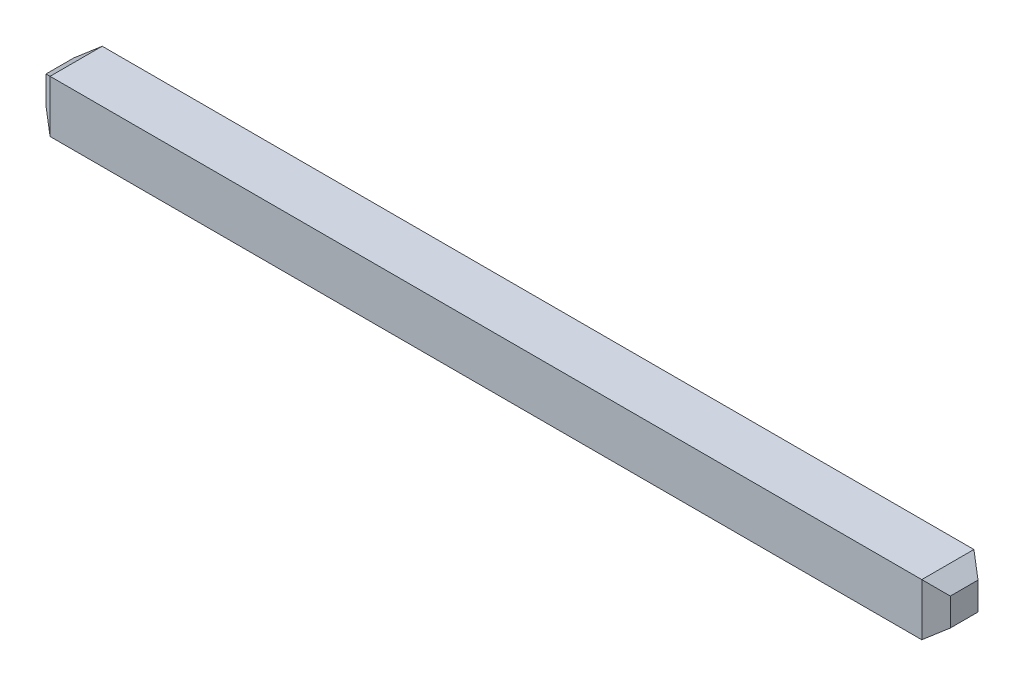
ISO-10303-21;
HEADER;
FILE_DESCRIPTION(('STEP AP214'),'2;1');
FILE_NAME('part.step','',(''),(''),'','','');
FILE_SCHEMA(('AUTOMOTIVE_DESIGN { 1 0 10303 214 1 1 1 1 }'));
ENDSEC;
DATA;
#1=APPLICATION_CONTEXT('core data for automotive mechanical design processes');
#2=APPLICATION_PROTOCOL_DEFINITION('international standard','automotive_design',2000,#1);
#3=PRODUCT_CONTEXT('',#1,'mechanical');
#4=PRODUCT('Part','Part','',(#3));
#5=PRODUCT_RELATED_PRODUCT_CATEGORY('part','',(#4));
#6=PRODUCT_DEFINITION_FORMATION('','',#4);
#7=PRODUCT_DEFINITION_CONTEXT('part definition',#1,'design');
#8=PRODUCT_DEFINITION('design','',#6,#7);
#9=PRODUCT_DEFINITION_SHAPE('','',#8);
#10=(LENGTH_UNIT() NAMED_UNIT(*) SI_UNIT(.MILLI.,.METRE.));
#11=(NAMED_UNIT(*) PLANE_ANGLE_UNIT() SI_UNIT($,.RADIAN.));
#12=(NAMED_UNIT(*) SI_UNIT($,.STERADIAN.) SOLID_ANGLE_UNIT());
#13=UNCERTAINTY_MEASURE_WITH_UNIT(LENGTH_MEASURE(1.E-05),#10,'distance_accuracy_value','');
#14=(GEOMETRIC_REPRESENTATION_CONTEXT(3) GLOBAL_UNCERTAINTY_ASSIGNED_CONTEXT((#13)) GLOBAL_UNIT_ASSIGNED_CONTEXT((#10,
#11,#12)) REPRESENTATION_CONTEXT('',''));
#15=CARTESIAN_POINT('',(0.,0.,0.));
#16=DIRECTION('',(0.,0.,1.));
#17=DIRECTION('',(1.,0.,0.));
#18=AXIS2_PLACEMENT_3D('',#15,#16,#17);
#19=CARTESIAN_POINT('',(-2.4,1.23,-4.055));
#20=DIRECTION('',(0.6,0.,0.8));
#21=DIRECTION('',(0.8,0.,-0.6));
#22=AXIS2_PLACEMENT_3D('',#19,#20,#21);
#23=PLANE('',#22);
#24=DIRECTION('',(0.,1.,0.));
#25=VECTOR('',#24,1.);
#26=CARTESIAN_POINT('',(-2.3,1.23,-4.13));
#27=LINE('',#26,#25);
#28=CARTESIAN_POINT('',(-2.3,1.55,-4.13));
#29=VERTEX_POINT('',#28);
#30=CARTESIAN_POINT('',(-2.30000000000001,0.909999999999898,-4.13));
#31=VERTEX_POINT('',#30);
#32=EDGE_CURVE('E101',#29,#31,#27,.F.);
#33=ORIENTED_EDGE('',*,*,#32,.T.);
#34=DIRECTION('',(-0.685994340569492,0.514495755428341,0.514495755427436));
#35=VECTOR('',#34,1.);
#36=CARTESIAN_POINT('',(-2.30000000000009,0.909999999999786,-4.13));
#37=LINE('',#36,#35);
#38=CARTESIAN_POINT('',(-2.49999999999999,1.06000000000001,-3.98));
#39=VERTEX_POINT('',#38);
#40=EDGE_CURVE('E85',#31,#39,#37,.T.);
#41=ORIENTED_EDGE('',*,*,#40,.T.);
#42=DIRECTION('',(0.,1.,0.));
#43=VECTOR('',#42,1.);
#44=CARTESIAN_POINT('',(-2.5,1.23,-3.98));
#45=LINE('',#44,#43);
#46=CARTESIAN_POINT('',(-2.5,1.4,-3.98));
#47=VERTEX_POINT('',#46);
#48=EDGE_CURVE('E79',#39,#47,#45,.T.);
#49=ORIENTED_EDGE('',*,*,#48,.T.);
#50=DIRECTION('',(-0.685994340570035,-0.514495755427527,0.514495755427526));
#51=VECTOR('',#50,1.);
#52=CARTESIAN_POINT('',(-2.3,1.55,-4.13));
#53=LINE('',#52,#51);
#54=EDGE_CURVE('E20',#29,#47,#53,.T.);
#55=ORIENTED_EDGE('',*,*,#54,.F.);
#56=EDGE_LOOP('',(#33,#41,#49,#55));
#57=FACE_BOUND('',#56,.T.);
#58=ADVANCED_FACE('F17',(#57),#23,.F.);
#59=CARTESIAN_POINT('',(8.5,1.23,-4.055));
#60=DIRECTION('',(-0.6,0.,0.8));
#61=DIRECTION('',(0.8,0.,0.6));
#62=AXIS2_PLACEMENT_3D('',#59,#60,#61);
#63=PLANE('',#62);
#64=DIRECTION('',(0.,1.,0.));
#65=VECTOR('',#64,1.);
#66=CARTESIAN_POINT('',(8.6,1.23,-3.98));
#67=LINE('',#66,#65);
#68=CARTESIAN_POINT('',(8.59999999999998,1.06000000000003,-3.98));
#69=VERTEX_POINT('',#68);
#70=CARTESIAN_POINT('',(8.6,1.4,-3.98));
#71=VERTEX_POINT('',#70);
#72=EDGE_CURVE('E113',#69,#71,#67,.T.);
#73=ORIENTED_EDGE('',*,*,#72,.F.);
#74=DIRECTION('',(-0.685994340569493,-0.514495755428341,-0.514495755427435));
#75=VECTOR('',#74,1.);
#76=CARTESIAN_POINT('',(8.59999999999996,1.06000000000005,-3.98));
#77=LINE('',#76,#75);
#78=CARTESIAN_POINT('',(8.40000000000002,0.909999999999884,-4.13));
#79=VERTEX_POINT('',#78);
#80=EDGE_CURVE('E108',#69,#79,#77,.T.);
#81=ORIENTED_EDGE('',*,*,#80,.T.);
#82=DIRECTION('',(0.,1.,0.));
#83=VECTOR('',#82,1.);
#84=CARTESIAN_POINT('',(8.4,1.23,-4.13));
#85=LINE('',#84,#83);
#86=CARTESIAN_POINT('',(8.4,1.55,-4.13));
#87=VERTEX_POINT('',#86);
#88=EDGE_CURVE('E99',#79,#87,#85,.T.);
#89=ORIENTED_EDGE('',*,*,#88,.T.);
#90=DIRECTION('',(-0.685994340570034,0.514495755427526,-0.514495755427529));
#91=VECTOR('',#90,1.);
#92=CARTESIAN_POINT('',(8.6,1.4,-3.98));
#93=LINE('',#92,#91);
#94=EDGE_CURVE('E116',#71,#87,#93,.T.);
#95=ORIENTED_EDGE('',*,*,#94,.F.);
#96=EDGE_LOOP('',(#73,#81,#89,#95));
#97=FACE_BOUND('',#96,.T.);
#98=ADVANCED_FACE('F214',(#97),#63,.F.);
#99=CARTESIAN_POINT('',(-2.4,1.475,-3.81));
#100=DIRECTION('',(-0.6,0.8,0.));
#101=DIRECTION('',(-0.8,-0.6,0.));
#102=AXIS2_PLACEMENT_3D('',#99,#100,#101);
#103=PLANE('',#102);
#104=DIRECTION('',(-0.685994340570036,-0.514495755427527,-0.514495755427525));
#105=VECTOR('',#104,1.);
#106=CARTESIAN_POINT('',(-2.3,1.55,-3.49));
#107=LINE('',#106,#105);
#108=CARTESIAN_POINT('',(-2.3,1.55,-3.49));
#109=VERTEX_POINT('',#108);
#110=CARTESIAN_POINT('',(-2.5,1.4,-3.64));
#111=VERTEX_POINT('',#110);
#112=EDGE_CURVE('E128',#109,#111,#107,.T.);
#113=ORIENTED_EDGE('',*,*,#112,.F.);
#114=DIRECTION('',(0.,0.,1.));
#115=VECTOR('',#114,1.);
#116=CARTESIAN_POINT('',(-2.3,1.55,-3.81));
#117=LINE('',#116,#115);
#118=EDGE_CURVE('E93',#29,#109,#117,.T.);
#119=ORIENTED_EDGE('',*,*,#118,.F.);
#120=ORIENTED_EDGE('',*,*,#54,.T.);
#121=DIRECTION('',(0.,0.,-1.));
#122=VECTOR('',#121,1.);
#123=CARTESIAN_POINT('',(-2.5,1.4,-3.81));
#124=LINE('',#123,#122);
#125=EDGE_CURVE('E87',#47,#111,#124,.F.);
#126=ORIENTED_EDGE('',*,*,#125,.T.);
#127=EDGE_LOOP('',(#113,#119,#120,#126));
#128=FACE_BOUND('',#127,.T.);
#129=ADVANCED_FACE('F90',(#128),#103,.T.);
#130=CARTESIAN_POINT('',(-2.5,1.23,-3.81));
#131=DIRECTION('',(1.,0.,0.));
#132=DIRECTION('',(0.,0.,-1.));
#133=AXIS2_PLACEMENT_3D('',#130,#131,#132);
#134=PLANE('',#133);
#135=DIRECTION('',(0.,1.,0.));
#136=VECTOR('',#135,1.);
#137=CARTESIAN_POINT('',(-2.5,1.23,-3.64));
#138=LINE('',#137,#136);
#139=CARTESIAN_POINT('',(-2.49999999999999,1.06000000000001,-3.64));
#140=VERTEX_POINT('',#139);
#141=EDGE_CURVE('E97',#111,#140,#138,.F.);
#142=ORIENTED_EDGE('',*,*,#141,.F.);
#143=ORIENTED_EDGE('',*,*,#125,.F.);
#144=ORIENTED_EDGE('',*,*,#48,.F.);
#145=DIRECTION('',(0.,0.,1.));
#146=VECTOR('',#145,1.);
#147=CARTESIAN_POINT('',(-2.49999999999996,1.06000000000005,-3.81));
#148=LINE('',#147,#146);
#149=EDGE_CURVE('E105',#39,#140,#148,.T.);
#150=ORIENTED_EDGE('',*,*,#149,.T.);
#151=EDGE_LOOP('',(#142,#143,#144,#150));
#152=FACE_BOUND('',#151,.T.);
#153=ADVANCED_FACE('F95',(#152),#134,.F.);
#154=CARTESIAN_POINT('',(3.05,1.23,-4.13));
#155=DIRECTION('',(0.,0.,1.));
#156=DIRECTION('',(1.,0.,0.));
#157=AXIS2_PLACEMENT_3D('',#154,#155,#156);
#158=PLANE('',#157);
#159=ORIENTED_EDGE('',*,*,#32,.F.);
#160=DIRECTION('',(1.,0.,0.));
#161=VECTOR('',#160,1.);
#162=CARTESIAN_POINT('',(3.05,1.55,-4.13));
#163=LINE('',#162,#161);
#164=EDGE_CURVE('E122',#87,#29,#163,.F.);
#165=ORIENTED_EDGE('',*,*,#164,.F.);
#166=ORIENTED_EDGE('',*,*,#88,.F.);
#167=DIRECTION('',(1.,0.,0.));
#168=VECTOR('',#167,1.);
#169=CARTESIAN_POINT('',(3.05,0.91,-4.13));
#170=LINE('',#169,#168);
#171=EDGE_CURVE('E136',#79,#31,#170,.F.);
#172=ORIENTED_EDGE('',*,*,#171,.T.);
#173=EDGE_LOOP('',(#159,#165,#166,#172));
#174=FACE_BOUND('',#173,.T.);
#175=ADVANCED_FACE('F182',(#174),#158,.F.);
#176=CARTESIAN_POINT('',(-2.4,0.9849999999999,-3.81));
#177=DIRECTION('',(0.600000000000912,0.799999999999316,0.));
#178=DIRECTION('',(-0.799999999999316,0.600000000000912,0.));
#179=AXIS2_PLACEMENT_3D('',#176,#177,#178);
#180=PLANE('',#179);
#181=DIRECTION('',(0.,0.,1.));
#182=VECTOR('',#181,1.);
#183=CARTESIAN_POINT('',(-2.3,0.91,-3.81));
#184=LINE('',#183,#182);
#185=CARTESIAN_POINT('',(-2.30000000000004,0.909999999999856,-3.49));
#186=VERTEX_POINT('',#185);
#187=EDGE_CURVE('E139',#31,#186,#184,.T.);
#188=ORIENTED_EDGE('',*,*,#187,.T.);
#189=DIRECTION('',(0.685994340569915,-0.514495755427779,0.514495755427434));
#190=VECTOR('',#189,1.);
#191=CARTESIAN_POINT('',(-2.5,1.06,-3.64));
#192=LINE('',#191,#190);
#193=EDGE_CURVE('E131',#140,#186,#192,.T.);
#194=ORIENTED_EDGE('',*,*,#193,.F.);
#195=ORIENTED_EDGE('',*,*,#149,.F.);
#196=ORIENTED_EDGE('',*,*,#40,.F.);
#197=EDGE_LOOP('',(#188,#194,#195,#196));
#198=FACE_BOUND('',#197,.T.);
#199=ADVANCED_FACE('F179',(#198),#180,.F.);
#200=CARTESIAN_POINT('',(8.5,0.9849999999999,-3.81));
#201=DIRECTION('',(-0.600000000000912,0.799999999999316,0.));
#202=DIRECTION('',(-0.799999999999316,-0.600000000000912,0.));
#203=AXIS2_PLACEMENT_3D('',#200,#201,#202);
#204=PLANE('',#203);
#205=DIRECTION('',(0.,0.,-1.));
#206=VECTOR('',#205,1.);
#207=CARTESIAN_POINT('',(8.6,1.06,-3.81));
#208=LINE('',#207,#206);
#209=CARTESIAN_POINT('',(8.59999999999998,1.06000000000003,-3.64));
#210=VERTEX_POINT('',#209);
#211=EDGE_CURVE('E110',#210,#69,#208,.T.);
#212=ORIENTED_EDGE('',*,*,#211,.F.);
#213=DIRECTION('',(0.685994340569913,0.514495755427781,-0.514495755427435));
#214=VECTOR('',#213,1.);
#215=CARTESIAN_POINT('',(8.4,0.9099999999999,-3.49));
#216=LINE('',#215,#214);
#217=CARTESIAN_POINT('',(8.40000000000004,0.909999999999868,-3.49));
#218=VERTEX_POINT('',#217);
#219=EDGE_CURVE('E35',#218,#210,#216,.T.);
#220=ORIENTED_EDGE('',*,*,#219,.F.);
#221=DIRECTION('',(0.,0.,1.));
#222=VECTOR('',#221,1.);
#223=CARTESIAN_POINT('',(8.4,0.91,-3.81));
#224=LINE('',#223,#222);
#225=EDGE_CURVE('E134',#218,#79,#224,.F.);
#226=ORIENTED_EDGE('',*,*,#225,.T.);
#227=ORIENTED_EDGE('',*,*,#80,.F.);
#228=EDGE_LOOP('',(#212,#220,#226,#227));
#229=FACE_BOUND('',#228,.T.);
#230=ADVANCED_FACE('F181',(#229),#204,.F.);
#231=CARTESIAN_POINT('',(8.6,1.23,-3.81));
#232=DIRECTION('',(1.,0.,0.));
#233=DIRECTION('',(0.,0.,-1.));
#234=AXIS2_PLACEMENT_3D('',#231,#232,#233);
#235=PLANE('',#234);
#236=ORIENTED_EDGE('',*,*,#72,.T.);
#237=DIRECTION('',(0.,0.,1.));
#238=VECTOR('',#237,1.);
#239=CARTESIAN_POINT('',(8.6,1.4,-3.81));
#240=LINE('',#239,#238);
#241=CARTESIAN_POINT('',(8.6,1.4,-3.64));
#242=VERTEX_POINT('',#241);
#243=EDGE_CURVE('E119',#242,#71,#240,.F.);
#244=ORIENTED_EDGE('',*,*,#243,.F.);
#245=DIRECTION('',(0.,1.,0.));
#246=VECTOR('',#245,1.);
#247=CARTESIAN_POINT('',(8.6,1.23,-3.64));
#248=LINE('',#247,#246);
#249=EDGE_CURVE('E142',#210,#242,#248,.T.);
#250=ORIENTED_EDGE('',*,*,#249,.F.);
#251=ORIENTED_EDGE('',*,*,#211,.T.);
#252=EDGE_LOOP('',(#236,#244,#250,#251));
#253=FACE_BOUND('',#252,.T.);
#254=ADVANCED_FACE('F189',(#253),#235,.T.);
#255=CARTESIAN_POINT('',(8.5,1.475,-3.81));
#256=DIRECTION('',(0.6,0.8,0.));
#257=DIRECTION('',(-0.8,0.6,0.));
#258=AXIS2_PLACEMENT_3D('',#255,#256,#257);
#259=PLANE('',#258);
#260=DIRECTION('',(-0.685994340570034,0.514495755427529,0.514495755427526));
#261=VECTOR('',#260,1.);
#262=CARTESIAN_POINT('',(8.6,1.4,-3.64));
#263=LINE('',#262,#261);
#264=CARTESIAN_POINT('',(8.4,1.55,-3.49));
#265=VERTEX_POINT('',#264);
#266=EDGE_CURVE('E145',#242,#265,#263,.T.);
#267=ORIENTED_EDGE('',*,*,#266,.F.);
#268=ORIENTED_EDGE('',*,*,#243,.T.);
#269=ORIENTED_EDGE('',*,*,#94,.T.);
#270=DIRECTION('',(0.,0.,1.));
#271=VECTOR('',#270,1.);
#272=CARTESIAN_POINT('',(8.4,1.55,-3.81));
#273=LINE('',#272,#271);
#274=EDGE_CURVE('E125',#265,#87,#273,.F.);
#275=ORIENTED_EDGE('',*,*,#274,.F.);
#276=EDGE_LOOP('',(#267,#268,#269,#275));
#277=FACE_BOUND('',#276,.T.);
#278=ADVANCED_FACE('F170',(#277),#259,.T.);
#279=CARTESIAN_POINT('',(3.05,1.55,-3.81));
#280=DIRECTION('',(0.,1.,0.));
#281=DIRECTION('',(0.,0.,1.));
#282=AXIS2_PLACEMENT_3D('',#279,#280,#281);
#283=PLANE('',#282);
#284=DIRECTION('',(1.,0.,0.));
#285=VECTOR('',#284,1.);
#286=CARTESIAN_POINT('',(3.05,1.55,-3.49));
#287=LINE('',#286,#285);
#288=EDGE_CURVE('E148',#265,#109,#287,.F.);
#289=ORIENTED_EDGE('',*,*,#288,.F.);
#290=ORIENTED_EDGE('',*,*,#274,.T.);
#291=ORIENTED_EDGE('',*,*,#164,.T.);
#292=ORIENTED_EDGE('',*,*,#118,.T.);
#293=EDGE_LOOP('',(#289,#290,#291,#292));
#294=FACE_BOUND('',#293,.T.);
#295=ADVANCED_FACE('F173',(#294),#283,.T.);
#296=CARTESIAN_POINT('',(-2.4,1.23,-3.565));
#297=DIRECTION('',(-0.6,0.,0.8));
#298=DIRECTION('',(0.8,0.,0.6));
#299=AXIS2_PLACEMENT_3D('',#296,#297,#298);
#300=PLANE('',#299);
#301=ORIENTED_EDGE('',*,*,#193,.T.);
#302=DIRECTION('',(0.,1.,0.));
#303=VECTOR('',#302,1.);
#304=CARTESIAN_POINT('',(-2.3,1.23,-3.49));
#305=LINE('',#304,#303);
#306=EDGE_CURVE('E151',#109,#186,#305,.F.);
#307=ORIENTED_EDGE('',*,*,#306,.F.);
#308=ORIENTED_EDGE('',*,*,#112,.T.);
#309=ORIENTED_EDGE('',*,*,#141,.T.);
#310=EDGE_LOOP('',(#301,#307,#308,#309));
#311=FACE_BOUND('',#310,.T.);
#312=ADVANCED_FACE('F176',(#311),#300,.T.);
#313=CARTESIAN_POINT('',(3.05,0.91,-3.81));
#314=DIRECTION('',(0.,1.,0.));
#315=DIRECTION('',(0.,0.,1.));
#316=AXIS2_PLACEMENT_3D('',#313,#314,#315);
#317=PLANE('',#316);
#318=ORIENTED_EDGE('',*,*,#187,.F.);
#319=ORIENTED_EDGE('',*,*,#171,.F.);
#320=ORIENTED_EDGE('',*,*,#225,.F.);
#321=DIRECTION('',(1.,0.,0.));
#322=VECTOR('',#321,1.);
#323=CARTESIAN_POINT('',(3.05,0.9099999999999,-3.49));
#324=LINE('',#323,#322);
#325=EDGE_CURVE('E26',#186,#218,#324,.T.);
#326=ORIENTED_EDGE('',*,*,#325,.F.);
#327=EDGE_LOOP('',(#318,#319,#320,#326));
#328=FACE_BOUND('',#327,.T.);
#329=ADVANCED_FACE('F162',(#328),#317,.F.);
#330=CARTESIAN_POINT('',(8.5,1.23,-3.565));
#331=DIRECTION('',(0.6,0.,0.8));
#332=DIRECTION('',(0.8,0.,-0.6));
#333=AXIS2_PLACEMENT_3D('',#330,#331,#332);
#334=PLANE('',#333);
#335=ORIENTED_EDGE('',*,*,#266,.T.);
#336=DIRECTION('',(0.,1.,0.));
#337=VECTOR('',#336,1.);
#338=CARTESIAN_POINT('',(8.4,1.23,-3.49));
#339=LINE('',#338,#337);
#340=EDGE_CURVE('E11',#218,#265,#339,.T.);
#341=ORIENTED_EDGE('',*,*,#340,.F.);
#342=ORIENTED_EDGE('',*,*,#219,.T.);
#343=ORIENTED_EDGE('',*,*,#249,.T.);
#344=EDGE_LOOP('',(#335,#341,#342,#343));
#345=FACE_BOUND('',#344,.T.);
#346=ADVANCED_FACE('F166',(#345),#334,.T.);
#347=CARTESIAN_POINT('',(3.05,1.23,-3.49));
#348=DIRECTION('',(0.,0.,1.));
#349=DIRECTION('',(1.,0.,0.));
#350=AXIS2_PLACEMENT_3D('',#347,#348,#349);
#351=PLANE('',#350);
#352=ORIENTED_EDGE('',*,*,#325,.T.);
#353=ORIENTED_EDGE('',*,*,#340,.T.);
#354=ORIENTED_EDGE('',*,*,#288,.T.);
#355=ORIENTED_EDGE('',*,*,#306,.T.);
#356=EDGE_LOOP('',(#352,#353,#354,#355));
#357=FACE_BOUND('',#356,.T.);
#358=ADVANCED_FACE('F157',(#357),#351,.T.);
#359=CLOSED_SHELL('',(#58,#98,#129,#153,#175,#199,#230,#254,#278,#295,#312,#329,#346,#358));
#360=MANIFOLD_SOLID_BREP('B1',#359);
#361=ADVANCED_BREP_SHAPE_REPRESENTATION('',(#18,#360),#14);
#362=SHAPE_DEFINITION_REPRESENTATION(#9,#361);
ENDSEC;
END-ISO-10303-21;
